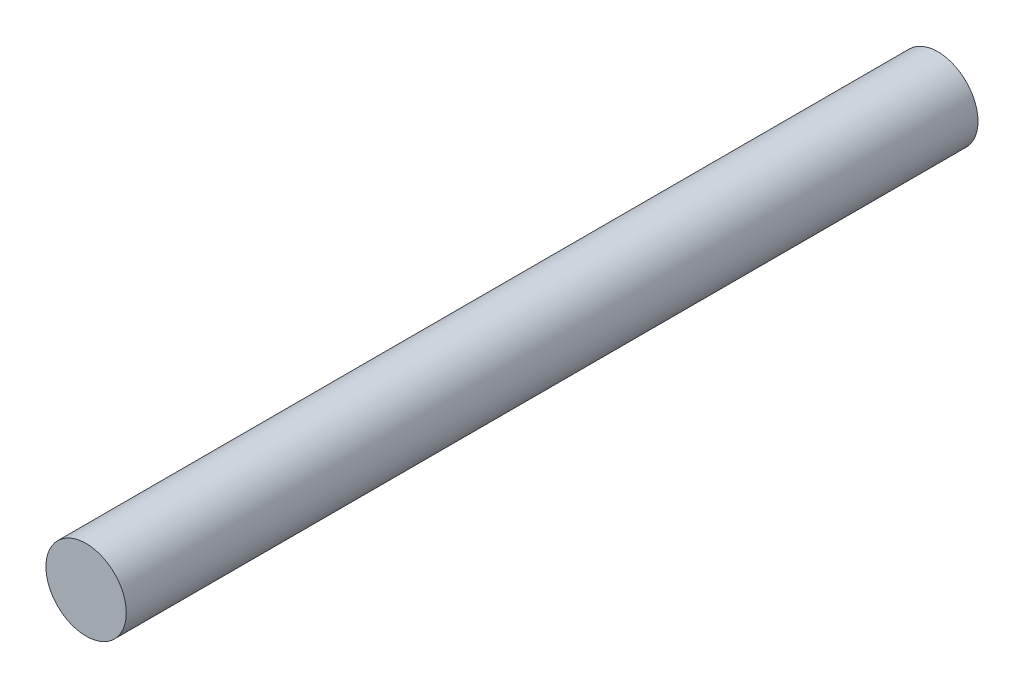
ISO-10303-21;
HEADER;
FILE_DESCRIPTION(('STEP AP214'),'2;1');
FILE_NAME('part.step','',(''),(''),'','','');
FILE_SCHEMA(('AUTOMOTIVE_DESIGN { 1 0 10303 214 1 1 1 1 }'));
ENDSEC;
DATA;
#1=APPLICATION_CONTEXT('core data for automotive mechanical design processes');
#2=APPLICATION_PROTOCOL_DEFINITION('international standard','automotive_design',2000,#1);
#3=PRODUCT_CONTEXT('',#1,'mechanical');
#4=PRODUCT('Part','Part','',(#3));
#5=PRODUCT_RELATED_PRODUCT_CATEGORY('part','',(#4));
#6=PRODUCT_DEFINITION_FORMATION('','',#4);
#7=PRODUCT_DEFINITION_CONTEXT('part definition',#1,'design');
#8=PRODUCT_DEFINITION('design','',#6,#7);
#9=PRODUCT_DEFINITION_SHAPE('','',#8);
#10=(LENGTH_UNIT() NAMED_UNIT(*) SI_UNIT(.MILLI.,.METRE.));
#11=(NAMED_UNIT(*) PLANE_ANGLE_UNIT() SI_UNIT($,.RADIAN.));
#12=(NAMED_UNIT(*) SI_UNIT($,.STERADIAN.) SOLID_ANGLE_UNIT());
#13=UNCERTAINTY_MEASURE_WITH_UNIT(LENGTH_MEASURE(1.E-05),#10,'distance_accuracy_value','');
#14=(GEOMETRIC_REPRESENTATION_CONTEXT(3) GLOBAL_UNCERTAINTY_ASSIGNED_CONTEXT((#13)) GLOBAL_UNIT_ASSIGNED_CONTEXT((#10,
#11,#12)) REPRESENTATION_CONTEXT('',''));
#15=CARTESIAN_POINT('',(0.,0.,0.));
#16=DIRECTION('',(0.,0.,1.));
#17=DIRECTION('',(1.,0.,0.));
#18=AXIS2_PLACEMENT_3D('',#15,#16,#17);
#19=CARTESIAN_POINT('',(0.,0.,26.5));
#20=DIRECTION('',(0.,0.,-1.));
#21=DIRECTION('',(-1.,0.,0.));
#22=AXIS2_PLACEMENT_3D('',#19,#20,#21);
#23=CYLINDRICAL_SURFACE('',#22,2.5);
#24=CARTESIAN_POINT('',(0.,0.,26.5));
#25=DIRECTION('',(0.,0.,1.));
#26=DIRECTION('',(1.,0.,0.));
#27=AXIS2_PLACEMENT_3D('',#24,#25,#26);
#28=CIRCLE('',#27,2.5);
#29=CARTESIAN_POINT('',(2.5,0.,26.5));
#30=VERTEX_POINT('',#29);
#31=EDGE_CURVE('E10',#30,#30,#28,.T.);
#32=ORIENTED_EDGE('',*,*,#31,.F.);
#33=EDGE_LOOP('',(#32));
#34=FACE_BOUND('',#33,.T.);
#35=CARTESIAN_POINT('',(0.,0.,-26.5));
#36=DIRECTION('',(0.,0.,1.));
#37=DIRECTION('',(1.,0.,0.));
#38=AXIS2_PLACEMENT_3D('',#35,#36,#37);
#39=CIRCLE('',#38,2.5);
#40=CARTESIAN_POINT('',(2.5,0.,-26.5));
#41=VERTEX_POINT('',#40);
#42=EDGE_CURVE('E33',#41,#41,#39,.T.);
#43=ORIENTED_EDGE('',*,*,#42,.T.);
#44=EDGE_LOOP('',(#43));
#45=FACE_BOUND('',#44,.T.);
#46=ADVANCED_FACE('F30',(#34,#45),#23,.T.);
#47=CARTESIAN_POINT('',(0.,0.,26.5));
#48=DIRECTION('',(0.,0.,1.));
#49=DIRECTION('',(1.,0.,0.));
#50=AXIS2_PLACEMENT_3D('',#47,#48,#49);
#51=PLANE('',#50);
#52=ORIENTED_EDGE('',*,*,#31,.T.);
#53=EDGE_LOOP('',(#52));
#54=FACE_BOUND('',#53,.T.);
#55=ADVANCED_FACE('F45',(#54),#51,.T.);
#56=CARTESIAN_POINT('',(0.,0.,-26.5));
#57=DIRECTION('',(0.,0.,1.));
#58=DIRECTION('',(1.,0.,0.));
#59=AXIS2_PLACEMENT_3D('',#56,#57,#58);
#60=PLANE('',#59);
#61=ORIENTED_EDGE('',*,*,#42,.F.);
#62=EDGE_LOOP('',(#61));
#63=FACE_BOUND('',#62,.T.);
#64=ADVANCED_FACE('F43',(#63),#60,.F.);
#65=CLOSED_SHELL('',(#46,#55,#64));
#66=MANIFOLD_SOLID_BREP('B2',#65);
#67=ADVANCED_BREP_SHAPE_REPRESENTATION('',(#18,#66),#14);
#68=SHAPE_DEFINITION_REPRESENTATION(#9,#67);
ENDSEC;
END-ISO-10303-21;
